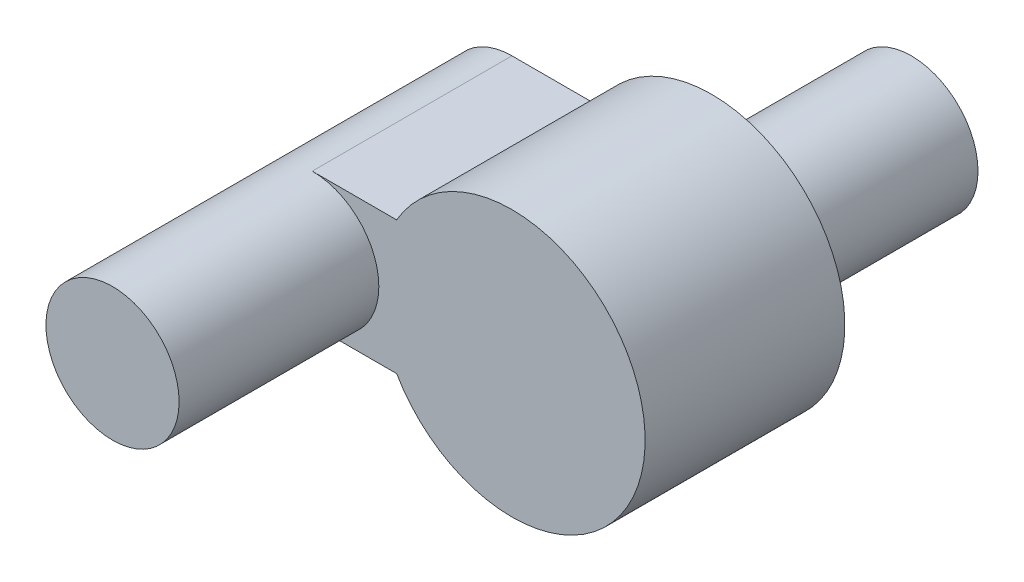
ISO-10303-21;
HEADER;
FILE_DESCRIPTION(('STEP AP214'),'2;1');
FILE_NAME('part.step','',(''),(''),'','','');
FILE_SCHEMA(('AUTOMOTIVE_DESIGN { 1 0 10303 214 1 1 1 1 }'));
ENDSEC;
DATA;
#1=APPLICATION_CONTEXT('core data for automotive mechanical design processes');
#2=APPLICATION_PROTOCOL_DEFINITION('international standard','automotive_design',2000,#1);
#3=PRODUCT_CONTEXT('',#1,'mechanical');
#4=PRODUCT('Part','Part','',(#3));
#5=PRODUCT_RELATED_PRODUCT_CATEGORY('part','',(#4));
#6=PRODUCT_DEFINITION_FORMATION('','',#4);
#7=PRODUCT_DEFINITION_CONTEXT('part definition',#1,'design');
#8=PRODUCT_DEFINITION('design','',#6,#7);
#9=PRODUCT_DEFINITION_SHAPE('','',#8);
#10=(LENGTH_UNIT() NAMED_UNIT(*) SI_UNIT(.MILLI.,.METRE.));
#11=(NAMED_UNIT(*) PLANE_ANGLE_UNIT() SI_UNIT($,.RADIAN.));
#12=(NAMED_UNIT(*) SI_UNIT($,.STERADIAN.) SOLID_ANGLE_UNIT());
#13=UNCERTAINTY_MEASURE_WITH_UNIT(LENGTH_MEASURE(1.E-05),#10,'distance_accuracy_value','');
#14=(GEOMETRIC_REPRESENTATION_CONTEXT(3) GLOBAL_UNCERTAINTY_ASSIGNED_CONTEXT((#13)) GLOBAL_UNIT_ASSIGNED_CONTEXT((#10,
#11,#12)) REPRESENTATION_CONTEXT('',''));
#15=CARTESIAN_POINT('',(0.,0.,0.));
#16=DIRECTION('',(0.,0.,1.));
#17=DIRECTION('',(1.,0.,0.));
#18=AXIS2_PLACEMENT_3D('',#15,#16,#17);
#19=CARTESIAN_POINT('',(0.,2.81977429522719,3.));
#20=DIRECTION('',(0.,1.,0.));
#21=DIRECTION('',(0.,0.,1.));
#22=AXIS2_PLACEMENT_3D('',#19,#20,#21);
#23=PLANE('',#22);
#24=DIRECTION('',(1.,0.,0.));
#25=VECTOR('',#24,1.);
#26=CARTESIAN_POINT('',(0.,2.81977429522719,0.));
#27=LINE('',#26,#25);
#28=CARTESIAN_POINT('',(-10.0740272022641,2.81977429522719,0.));
#29=VERTEX_POINT('',#28);
#30=CARTESIAN_POINT('',(-8.80607800983302,2.81977429522719,0.));
#31=VERTEX_POINT('',#30);
#32=EDGE_CURVE('E104',#29,#31,#27,.T.);
#33=ORIENTED_EDGE('',*,*,#32,.T.);
#34=DIRECTION('',(0.,0.,-1.));
#35=VECTOR('',#34,1.);
#36=CARTESIAN_POINT('',(-8.80607800983302,2.81977429522719,3.));
#37=LINE('',#36,#35);
#38=CARTESIAN_POINT('',(-8.80607800983302,2.81977429522719,3.));
#39=VERTEX_POINT('',#38);
#40=EDGE_CURVE('E95',#39,#31,#37,.T.);
#41=ORIENTED_EDGE('',*,*,#40,.F.);
#42=DIRECTION('',(1.,0.,0.));
#43=VECTOR('',#42,1.);
#44=CARTESIAN_POINT('',(0.,2.81977429522719,3.));
#45=LINE('',#44,#43);
#46=CARTESIAN_POINT('',(-10.0740272022641,2.81977429522719,3.));
#47=VERTEX_POINT('',#46);
#48=EDGE_CURVE('E101',#47,#39,#45,.T.);
#49=ORIENTED_EDGE('',*,*,#48,.F.);
#50=DIRECTION('',(0.,0.,-1.));
#51=VECTOR('',#50,1.);
#52=CARTESIAN_POINT('',(-10.0740272022641,2.81977429522719,3.));
#53=LINE('',#52,#51);
#54=EDGE_CURVE('E84',#47,#29,#53,.T.);
#55=ORIENTED_EDGE('',*,*,#54,.T.);
#56=EDGE_LOOP('',(#33,#41,#49,#55));
#57=FACE_BOUND('',#56,.T.);
#58=ADVANCED_FACE('F37',(#57),#23,.F.);
#59=CARTESIAN_POINT('',(-7.07402720226415,3.81977429522719,3.));
#60=DIRECTION('',(0.,0.,-1.));
#61=DIRECTION('',(-1.,0.,0.));
#62=AXIS2_PLACEMENT_3D('',#59,#60,#61);
#63=CYLINDRICAL_SURFACE('',#62,2.);
#64=CARTESIAN_POINT('',(-7.07402720226415,3.81977429522719,0.));
#65=DIRECTION('',(0.,0.,1.));
#66=DIRECTION('',(1.,0.,0.));
#67=AXIS2_PLACEMENT_3D('',#64,#65,#66);
#68=CIRCLE('',#67,2.);
#69=CARTESIAN_POINT('',(-8.80607800983302,4.81977429522719,0.));
#70=VERTEX_POINT('',#69);
#71=EDGE_CURVE('E107',#31,#70,#68,.T.);
#72=ORIENTED_EDGE('',*,*,#71,.T.);
#73=DIRECTION('',(0.,0.,-1.));
#74=VECTOR('',#73,1.);
#75=CARTESIAN_POINT('',(-8.80607800983302,4.81977429522719,3.));
#76=LINE('',#75,#74);
#77=CARTESIAN_POINT('',(-8.80607800983302,4.81977429522719,3.));
#78=VERTEX_POINT('',#77);
#79=EDGE_CURVE('E90',#78,#70,#76,.T.);
#80=ORIENTED_EDGE('',*,*,#79,.F.);
#81=CARTESIAN_POINT('',(-7.07402720226415,3.81977429522719,3.));
#82=DIRECTION('',(0.,0.,1.));
#83=DIRECTION('',(1.,0.,0.));
#84=AXIS2_PLACEMENT_3D('',#81,#82,#83);
#85=CIRCLE('',#84,2.);
#86=EDGE_CURVE('E78',#39,#78,#85,.T.);
#87=ORIENTED_EDGE('',*,*,#86,.F.);
#88=ORIENTED_EDGE('',*,*,#40,.T.);
#89=EDGE_LOOP('',(#72,#80,#87,#88));
#90=FACE_BOUND('',#89,.T.);
#91=ADVANCED_FACE('F113',(#90),#63,.T.);
#92=CARTESIAN_POINT('',(0.,4.8197742952272,3.));
#93=DIRECTION('',(0.,1.,0.));
#94=DIRECTION('',(-1.,0.,0.));
#95=AXIS2_PLACEMENT_3D('',#92,#93,#94);
#96=PLANE('',#95);
#97=DIRECTION('',(1.,0.,0.));
#98=VECTOR('',#97,1.);
#99=CARTESIAN_POINT('',(0.,4.8197742952272,0.));
#100=LINE('',#99,#98);
#101=CARTESIAN_POINT('',(-10.0740272022641,4.81977429522719,0.));
#102=VERTEX_POINT('',#101);
#103=EDGE_CURVE('E89',#102,#70,#100,.T.);
#104=ORIENTED_EDGE('',*,*,#103,.F.);
#105=DIRECTION('',(0.,0.,-1.));
#106=VECTOR('',#105,1.);
#107=CARTESIAN_POINT('',(-10.0740272022641,4.81977429522719,3.));
#108=LINE('',#107,#106);
#109=CARTESIAN_POINT('',(-10.0740272022641,4.81977429522719,3.));
#110=VERTEX_POINT('',#109);
#111=EDGE_CURVE('E70',#110,#102,#108,.T.);
#112=ORIENTED_EDGE('',*,*,#111,.F.);
#113=DIRECTION('',(1.,0.,0.));
#114=VECTOR('',#113,1.);
#115=CARTESIAN_POINT('',(0.,4.8197742952272,3.));
#116=LINE('',#115,#114);
#117=EDGE_CURVE('E81',#110,#78,#116,.T.);
#118=ORIENTED_EDGE('',*,*,#117,.T.);
#119=ORIENTED_EDGE('',*,*,#79,.T.);
#120=EDGE_LOOP('',(#104,#112,#118,#119));
#121=FACE_BOUND('',#120,.T.);
#122=ADVANCED_FACE('F87',(#121),#96,.T.);
#123=CARTESIAN_POINT('',(-10.0740272022641,3.81977429522719,3.));
#124=DIRECTION('',(0.,0.,-1.));
#125=DIRECTION('',(-1.,0.,0.));
#126=AXIS2_PLACEMENT_3D('',#123,#124,#125);
#127=CYLINDRICAL_SURFACE('',#126,1.);
#128=CARTESIAN_POINT('',(-10.0740272022641,3.81977429522719,0.));
#129=DIRECTION('',(0.,0.,1.));
#130=DIRECTION('',(1.,0.,0.));
#131=AXIS2_PLACEMENT_3D('',#128,#129,#130);
#132=CIRCLE('',#131,1.);
#133=EDGE_CURVE('E72',#102,#29,#132,.T.);
#134=ORIENTED_EDGE('',*,*,#133,.T.);
#135=ORIENTED_EDGE('',*,*,#54,.F.);
#136=CARTESIAN_POINT('',(-10.0740272022641,3.81977429522719,3.));
#137=DIRECTION('',(0.,0.,1.));
#138=DIRECTION('',(1.,0.,0.));
#139=AXIS2_PLACEMENT_3D('',#136,#137,#138);
#140=CIRCLE('',#139,1.);
#141=EDGE_CURVE('E45',#47,#110,#140,.T.);
#142=ORIENTED_EDGE('',*,*,#141,.T.);
#143=ORIENTED_EDGE('',*,*,#111,.T.);
#144=EDGE_LOOP('',(#134,#135,#142,#143));
#145=FACE_BOUND('',#144,.T.);
#146=CARTESIAN_POINT('',(-10.0740272022641,3.81977429522719,6.));
#147=DIRECTION('',(0.,0.,1.));
#148=DIRECTION('',(1.,0.,0.));
#149=AXIS2_PLACEMENT_3D('',#146,#147,#148);
#150=CIRCLE('',#149,1.);
#151=CARTESIAN_POINT('',(-9.07402720226415,3.81977429522719,6.));
#152=VERTEX_POINT('',#151);
#153=EDGE_CURVE('E99',#152,#152,#150,.T.);
#154=ORIENTED_EDGE('',*,*,#153,.F.);
#155=EDGE_LOOP('',(#154));
#156=FACE_BOUND('',#155,.T.);
#157=ADVANCED_FACE('F92',(#145,#156),#127,.T.);
#158=CARTESIAN_POINT('',(0.,0.,3.));
#159=DIRECTION('',(0.,0.,1.));
#160=DIRECTION('',(1.,0.,0.));
#161=AXIS2_PLACEMENT_3D('',#158,#159,#160);
#162=PLANE('',#161);
#163=ORIENTED_EDGE('',*,*,#141,.F.);
#164=ORIENTED_EDGE('',*,*,#48,.T.);
#165=ORIENTED_EDGE('',*,*,#86,.T.);
#166=ORIENTED_EDGE('',*,*,#117,.F.);
#167=EDGE_LOOP('',(#163,#164,#165,#166));
#168=FACE_BOUND('',#167,.T.);
#169=ADVANCED_FACE('F82',(#168),#162,.T.);
#170=CARTESIAN_POINT('',(0.,0.,0.));
#171=DIRECTION('',(0.,0.,1.));
#172=DIRECTION('',(1.,0.,0.));
#173=AXIS2_PLACEMENT_3D('',#170,#171,#172);
#174=PLANE('',#173);
#175=CARTESIAN_POINT('',(-7.07402720226415,3.81977429522719,0.));
#176=DIRECTION('',(0.,0.,1.));
#177=DIRECTION('',(1.,0.,0.));
#178=AXIS2_PLACEMENT_3D('',#175,#176,#177);
#179=CIRCLE('',#178,1.);
#180=CARTESIAN_POINT('',(-6.07402720226415,3.81977429522719,0.));
#181=VERTEX_POINT('',#180);
#182=EDGE_CURVE('E11',#181,#181,#179,.F.);
#183=ORIENTED_EDGE('',*,*,#182,.F.);
#184=EDGE_LOOP('',(#183));
#185=FACE_BOUND('',#184,.T.);
#186=ORIENTED_EDGE('',*,*,#32,.F.);
#187=ORIENTED_EDGE('',*,*,#133,.F.);
#188=ORIENTED_EDGE('',*,*,#103,.T.);
#189=ORIENTED_EDGE('',*,*,#71,.F.);
#190=EDGE_LOOP('',(#186,#187,#188,#189));
#191=FACE_BOUND('',#190,.T.);
#192=ADVANCED_FACE('F117',(#185,#191),#174,.F.);
#193=CARTESIAN_POINT('',(-10.0740272022641,3.81977429522719,6.));
#194=DIRECTION('',(0.,0.,1.));
#195=DIRECTION('',(1.,0.,0.));
#196=AXIS2_PLACEMENT_3D('',#193,#194,#195);
#197=PLANE('',#196);
#198=ORIENTED_EDGE('',*,*,#153,.T.);
#199=EDGE_LOOP('',(#198));
#200=FACE_BOUND('',#199,.T.);
#201=ADVANCED_FACE('F132',(#200),#197,.T.);
#202=CARTESIAN_POINT('',(-7.07402720226415,3.81977429522719,-3.));
#203=DIRECTION('',(0.,0.,1.));
#204=DIRECTION('',(1.,0.,0.));
#205=AXIS2_PLACEMENT_3D('',#202,#203,#204);
#206=CYLINDRICAL_SURFACE('',#205,1.);
#207=CARTESIAN_POINT('',(-7.07402720226415,3.81977429522719,-3.));
#208=DIRECTION('',(0.,0.,-1.));
#209=DIRECTION('',(-1.,0.,0.));
#210=AXIS2_PLACEMENT_3D('',#207,#208,#209);
#211=CIRCLE('',#210,1.);
#212=CARTESIAN_POINT('',(-8.07402720226415,3.81977429522719,-3.));
#213=VERTEX_POINT('',#212);
#214=EDGE_CURVE('E150',#213,#213,#211,.T.);
#215=ORIENTED_EDGE('',*,*,#214,.F.);
#216=EDGE_LOOP('',(#215));
#217=FACE_BOUND('',#216,.T.);
#218=ORIENTED_EDGE('',*,*,#182,.T.);
#219=EDGE_LOOP('',(#218));
#220=FACE_BOUND('',#219,.T.);
#221=ADVANCED_FACE('F138',(#217,#220),#206,.T.);
#222=CARTESIAN_POINT('',(-7.07402720226415,3.81977429522719,-3.));
#223=DIRECTION('',(0.,0.,-1.));
#224=DIRECTION('',(-1.,0.,0.));
#225=AXIS2_PLACEMENT_3D('',#222,#223,#224);
#226=PLANE('',#225);
#227=ORIENTED_EDGE('',*,*,#214,.T.);
#228=EDGE_LOOP('',(#227));
#229=FACE_BOUND('',#228,.T.);
#230=ADVANCED_FACE('F142',(#229),#226,.T.);
#231=CLOSED_SHELL('',(#58,#91,#122,#157,#169,#192,#201,#221,#230));
#232=MANIFOLD_SOLID_BREP('B2',#231);
#233=ADVANCED_BREP_SHAPE_REPRESENTATION('',(#18,#232),#14);
#234=SHAPE_DEFINITION_REPRESENTATION(#9,#233);
ENDSEC;
END-ISO-10303-21;
